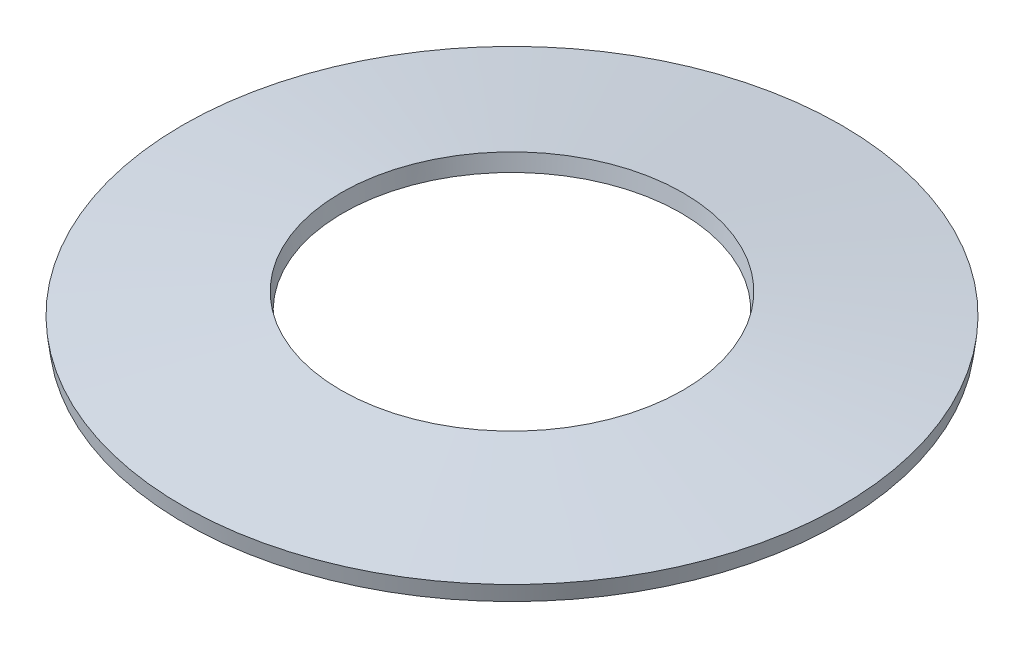
ISO-10303-21;
HEADER;
FILE_DESCRIPTION(('STEP AP214'),'2;1');
FILE_NAME('part.step','',(''),(''),'','','');
FILE_SCHEMA(('AUTOMOTIVE_DESIGN { 1 0 10303 214 1 1 1 1 }'));
ENDSEC;
DATA;
#1=APPLICATION_CONTEXT('core data for automotive mechanical design processes');
#2=APPLICATION_PROTOCOL_DEFINITION('international standard','automotive_design',2000,#1);
#3=PRODUCT_CONTEXT('',#1,'mechanical');
#4=PRODUCT('Part','Part','',(#3));
#5=PRODUCT_RELATED_PRODUCT_CATEGORY('part','',(#4));
#6=PRODUCT_DEFINITION_FORMATION('','',#4);
#7=PRODUCT_DEFINITION_CONTEXT('part definition',#1,'design');
#8=PRODUCT_DEFINITION('design','',#6,#7);
#9=PRODUCT_DEFINITION_SHAPE('','',#8);
#10=(LENGTH_UNIT() NAMED_UNIT(*) SI_UNIT(.MILLI.,.METRE.));
#11=(NAMED_UNIT(*) PLANE_ANGLE_UNIT() SI_UNIT($,.RADIAN.));
#12=(NAMED_UNIT(*) SI_UNIT($,.STERADIAN.) SOLID_ANGLE_UNIT());
#13=UNCERTAINTY_MEASURE_WITH_UNIT(LENGTH_MEASURE(1.E-05),#10,'distance_accuracy_value','');
#14=(GEOMETRIC_REPRESENTATION_CONTEXT(3) GLOBAL_UNCERTAINTY_ASSIGNED_CONTEXT((#13)) GLOBAL_UNIT_ASSIGNED_CONTEXT((#10,
#11,#12)) REPRESENTATION_CONTEXT('',''));
#15=CARTESIAN_POINT('',(0.,0.,0.));
#16=DIRECTION('',(0.,0.,1.));
#17=DIRECTION('',(1.,0.,0.));
#18=AXIS2_PLACEMENT_3D('',#15,#16,#17);
#19=CARTESIAN_POINT('',(0.,0.3462830514,0.));
#20=DIRECTION('',(0.,-1.,0.));
#21=DIRECTION('',(0.,0.,-1.));
#22=AXIS2_PLACEMENT_3D('',#19,#20,#21);
#23=CONICAL_SURFACE('',#22,8.3848117292,1.44072312418481);
#24=CARTESIAN_POINT('',(0.,0.900000005669429,0.));
#25=DIRECTION('',(0.,-1.,0.));
#26=DIRECTION('',(0.,0.,-1.));
#27=AXIS2_PLACEMENT_3D('',#24,#25,#26);
#28=CIRCLE('',#27,4.15188269074027);
#29=CARTESIAN_POINT('',(0.,0.900000005669429,-4.15188269074027));
#30=VERTEX_POINT('',#29);
#31=EDGE_CURVE('E27',#30,#30,#28,.T.);
#32=ORIENTED_EDGE('',*,*,#31,.T.);
#33=EDGE_LOOP('',(#32));
#34=FACE_BOUND('',#33,.T.);
#35=CARTESIAN_POINT('',(0.,0.39662095377852,0.));
#36=DIRECTION('',(0.,-1.,0.));
#37=DIRECTION('',(0.,0.,-1.));
#38=AXIS2_PLACEMENT_3D('',#35,#36,#37);
#39=CIRCLE('',#38,7.99999998814027);
#40=CARTESIAN_POINT('',(0.,0.39662095377852,-7.99999998814027));
#41=VERTEX_POINT('',#40);
#42=EDGE_CURVE('E18',#41,#41,#39,.T.);
#43=ORIENTED_EDGE('',*,*,#42,.F.);
#44=EDGE_LOOP('',(#43));
#45=FACE_BOUND('',#44,.T.);
#46=ADVANCED_FACE('F14',(#34,#45),#23,.T.);
#47=CARTESIAN_POINT('',(0.,0.4362830492,0.));
#48=DIRECTION('',(0.,1.,0.));
#49=DIRECTION('',(0.,0.,1.));
#50=AXIS2_PLACEMENT_3D('',#47,#48,#49);
#51=CONICAL_SURFACE('',#50,8.0051882568,0.130073194073389);
#52=CARTESIAN_POINT('',(0.,4.66851971442145E-09,0.));
#53=DIRECTION('',(0.,1.,0.));
#54=DIRECTION('',(-1.,0.,0.));
#55=AXIS2_PLACEMENT_3D('',#52,#53,#54);
#56=CIRCLE('',#55,7.9481172989061);
#57=CARTESIAN_POINT('',(-7.9481172989061,4.66851971272738E-09,0.));
#58=VERTEX_POINT('',#57);
#59=EDGE_CURVE('E22',#58,#58,#56,.T.);
#60=ORIENTED_EDGE('',*,*,#59,.T.);
#61=EDGE_LOOP('',(#60));
#62=FACE_BOUND('',#61,.T.);
#63=ORIENTED_EDGE('',*,*,#42,.T.);
#64=EDGE_LOOP('',(#63));
#65=FACE_BOUND('',#64,.T.);
#66=ADVANCED_FACE('F35',(#62,#65),#51,.T.);
#67=CARTESIAN_POINT('',(0.,0.9396621034,0.));
#68=DIRECTION('',(0.,1.,0.));
#69=DIRECTION('',(0.,0.,1.));
#70=AXIS2_PLACEMENT_3D('',#67,#68,#69);
#71=CONICAL_SURFACE('',#70,4.1570709594,0.130073186585772);
#72=CARTESIAN_POINT('',(0.,0.5033790288,0.));
#73=DIRECTION('',(0.,-1.,0.));
#74=DIRECTION('',(0.,0.,-1.));
#75=AXIS2_PLACEMENT_3D('',#72,#73,#74);
#76=CIRCLE('',#75,4.1000000042);
#77=CARTESIAN_POINT('',(0.,0.5033790288,-4.1000000042));
#78=VERTEX_POINT('',#77);
#79=EDGE_CURVE('E10',#78,#78,#76,.T.);
#80=ORIENTED_EDGE('',*,*,#79,.T.);
#81=EDGE_LOOP('',(#80));
#82=FACE_BOUND('',#81,.T.);
#83=ORIENTED_EDGE('',*,*,#31,.F.);
#84=EDGE_LOOP('',(#83));
#85=FACE_BOUND('',#84,.T.);
#86=ADVANCED_FACE('F43',(#82,#85),#71,.F.);
#87=CARTESIAN_POINT('',(0.,-0.0503378978,0.));
#88=DIRECTION('',(0.,-1.,0.));
#89=DIRECTION('',(1.,0.,0.));
#90=AXIS2_PLACEMENT_3D('',#87,#88,#89);
#91=CONICAL_SURFACE('',#90,8.3329290288,1.44072312931269);
#92=ORIENTED_EDGE('',*,*,#59,.F.);
#93=EDGE_LOOP('',(#92));
#94=FACE_BOUND('',#93,.T.);
#95=ORIENTED_EDGE('',*,*,#79,.F.);
#96=EDGE_LOOP('',(#95));
#97=FACE_BOUND('',#96,.T.);
#98=ADVANCED_FACE('F16',(#94,#97),#91,.F.);
#99=CLOSED_SHELL('',(#46,#66,#86,#98));
#100=MANIFOLD_SOLID_BREP('B1',#99);
#101=ADVANCED_BREP_SHAPE_REPRESENTATION('',(#18,#100),#14);
#102=SHAPE_DEFINITION_REPRESENTATION(#9,#101);
ENDSEC;
END-ISO-10303-21;
